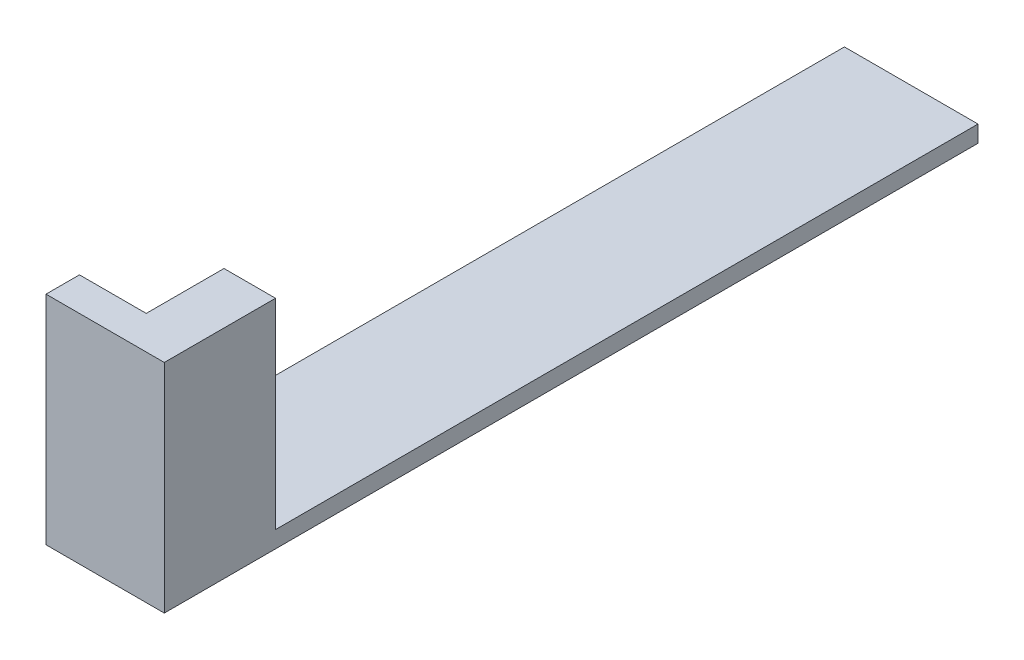
ISO-10303-21;
HEADER;
FILE_DESCRIPTION(('STEP AP214'),'2;1');
FILE_NAME('part.step','',(''),(''),'','','');
FILE_SCHEMA(('AUTOMOTIVE_DESIGN { 1 0 10303 214 1 1 1 1 }'));
ENDSEC;
DATA;
#1=APPLICATION_CONTEXT('core data for automotive mechanical design processes');
#2=APPLICATION_PROTOCOL_DEFINITION('international standard','automotive_design',2000,#1);
#3=PRODUCT_CONTEXT('',#1,'mechanical');
#4=PRODUCT('Part','Part','',(#3));
#5=PRODUCT_RELATED_PRODUCT_CATEGORY('part','',(#4));
#6=PRODUCT_DEFINITION_FORMATION('','',#4);
#7=PRODUCT_DEFINITION_CONTEXT('part definition',#1,'design');
#8=PRODUCT_DEFINITION('design','',#6,#7);
#9=PRODUCT_DEFINITION_SHAPE('','',#8);
#10=(LENGTH_UNIT() NAMED_UNIT(*) SI_UNIT(.MILLI.,.METRE.));
#11=(NAMED_UNIT(*) PLANE_ANGLE_UNIT() SI_UNIT($,.RADIAN.));
#12=(NAMED_UNIT(*) SI_UNIT($,.STERADIAN.) SOLID_ANGLE_UNIT());
#13=UNCERTAINTY_MEASURE_WITH_UNIT(LENGTH_MEASURE(1.E-05),#10,'distance_accuracy_value','');
#14=(GEOMETRIC_REPRESENTATION_CONTEXT(3) GLOBAL_UNCERTAINTY_ASSIGNED_CONTEXT((#13)) GLOBAL_UNIT_ASSIGNED_CONTEXT((#10,
#11,#12)) REPRESENTATION_CONTEXT('',''));
#15=CARTESIAN_POINT('',(0.,0.,0.));
#16=DIRECTION('',(0.,0.,1.));
#17=DIRECTION('',(1.,0.,0.));
#18=AXIS2_PLACEMENT_3D('',#15,#16,#17);
#19=CARTESIAN_POINT('',(0.,1.,0.));
#20=DIRECTION('',(0.,-1.,0.));
#21=DIRECTION('',(0.,0.,-1.));
#22=AXIS2_PLACEMENT_3D('',#19,#20,#21);
#23=PLANE('',#22);
#24=DIRECTION('',(-1.,0.,0.));
#25=VECTOR('',#24,1.);
#26=CARTESIAN_POINT('',(4.91519608556246,1.,0.));
#27=LINE('',#26,#25);
#28=CARTESIAN_POINT('',(8.,1.,0.));
#29=VERTEX_POINT('',#28);
#30=CARTESIAN_POINT('',(4.91519608556246,1.,0.));
#31=VERTEX_POINT('',#30);
#32=EDGE_CURVE('E158',#29,#31,#27,.T.);
#33=ORIENTED_EDGE('',*,*,#32,.F.);
#34=DIRECTION('',(0.,0.,-1.));
#35=VECTOR('',#34,1.);
#36=CARTESIAN_POINT('',(8.,1.,0.));
#37=LINE('',#36,#35);
#38=CARTESIAN_POINT('',(8.,1.,-42.07));
#39=VERTEX_POINT('',#38);
#40=EDGE_CURVE('E144',#29,#39,#37,.T.);
#41=ORIENTED_EDGE('',*,*,#40,.T.);
#42=DIRECTION('',(-1.,0.,0.));
#43=VECTOR('',#42,1.);
#44=CARTESIAN_POINT('',(0.,1.,-42.07));
#45=LINE('',#44,#43);
#46=CARTESIAN_POINT('',(0.,1.,-42.07));
#47=VERTEX_POINT('',#46);
#48=EDGE_CURVE('E64',#39,#47,#45,.T.);
#49=ORIENTED_EDGE('',*,*,#48,.T.);
#50=DIRECTION('',(0.,0.,1.));
#51=VECTOR('',#50,1.);
#52=CARTESIAN_POINT('',(0.,1.,0.));
#53=LINE('',#52,#51);
#54=CARTESIAN_POINT('',(0.,1.,0.));
#55=VERTEX_POINT('',#54);
#56=EDGE_CURVE('E201',#47,#55,#53,.T.);
#57=ORIENTED_EDGE('',*,*,#56,.T.);
#58=DIRECTION('',(1.,0.,0.));
#59=VECTOR('',#58,1.);
#60=CARTESIAN_POINT('',(0.,1.,0.));
#61=LINE('',#60,#59);
#62=EDGE_CURVE('E87',#55,#31,#61,.T.);
#63=ORIENTED_EDGE('',*,*,#62,.T.);
#64=EDGE_LOOP('',(#33,#41,#49,#57,#63));
#65=FACE_BOUND('',#64,.T.);
#66=ADVANCED_FACE('F39',(#65),#23,.F.);
#67=CARTESIAN_POINT('',(0.915196085562456,0.,4.65685647861847));
#68=DIRECTION('',(0.,0.,1.));
#69=DIRECTION('',(1.,0.,0.));
#70=AXIS2_PLACEMENT_3D('',#67,#68,#69);
#71=PLANE('',#70);
#72=DIRECTION('',(-1.,0.,0.));
#73=VECTOR('',#72,1.);
#74=CARTESIAN_POINT('',(8.,13.,4.65685647861847));
#75=LINE('',#74,#73);
#76=CARTESIAN_POINT('',(4.91519608556246,13.,4.65685647861847));
#77=VERTEX_POINT('',#76);
#78=CARTESIAN_POINT('',(0.915196085562456,13.,4.65685647861847));
#79=VERTEX_POINT('',#78);
#80=EDGE_CURVE('E138',#77,#79,#75,.T.);
#81=ORIENTED_EDGE('',*,*,#80,.F.);
#82=DIRECTION('',(0.,-1.,0.));
#83=VECTOR('',#82,1.);
#84=CARTESIAN_POINT('',(4.91519608556246,0.,4.65685647861847));
#85=LINE('',#84,#83);
#86=CARTESIAN_POINT('',(4.91519608556246,0.,4.65685647861847));
#87=VERTEX_POINT('',#86);
#88=EDGE_CURVE('E55',#77,#87,#85,.T.);
#89=ORIENTED_EDGE('',*,*,#88,.T.);
#90=DIRECTION('',(1.,0.,0.));
#91=VECTOR('',#90,1.);
#92=CARTESIAN_POINT('',(0.915196085562456,0.,4.65685647861847));
#93=LINE('',#92,#91);
#94=CARTESIAN_POINT('',(0.915196085562456,0.,4.65685647861847));
#95=VERTEX_POINT('',#94);
#96=EDGE_CURVE('E181',#95,#87,#93,.T.);
#97=ORIENTED_EDGE('',*,*,#96,.F.);
#98=DIRECTION('',(0.,-1.,0.));
#99=VECTOR('',#98,1.);
#100=CARTESIAN_POINT('',(0.915196085562456,0.,4.65685647861847));
#101=LINE('',#100,#99);
#102=EDGE_CURVE('E170',#79,#95,#101,.T.);
#103=ORIENTED_EDGE('',*,*,#102,.F.);
#104=EDGE_LOOP('',(#81,#89,#97,#103));
#105=FACE_BOUND('',#104,.T.);
#106=ADVANCED_FACE('F239',(#105),#71,.F.);
#107=CARTESIAN_POINT('',(4.91519608556246,0.,4.66));
#108=DIRECTION('',(1.,0.,0.));
#109=DIRECTION('',(0.,0.,-1.));
#110=AXIS2_PLACEMENT_3D('',#107,#108,#109);
#111=PLANE('',#110);
#112=ORIENTED_EDGE('',*,*,#88,.F.);
#113=DIRECTION('',(0.,0.,1.));
#114=VECTOR('',#113,1.);
#115=CARTESIAN_POINT('',(4.91519608556246,13.,0.));
#116=LINE('',#115,#114);
#117=CARTESIAN_POINT('',(4.91519608556246,13.,0.));
#118=VERTEX_POINT('',#117);
#119=EDGE_CURVE('E153',#118,#77,#116,.T.);
#120=ORIENTED_EDGE('',*,*,#119,.F.);
#121=DIRECTION('',(0.,-1.,0.));
#122=VECTOR('',#121,1.);
#123=CARTESIAN_POINT('',(4.91519608556246,13.,0.));
#124=LINE('',#123,#122);
#125=EDGE_CURVE('E148',#118,#31,#124,.T.);
#126=ORIENTED_EDGE('',*,*,#125,.T.);
#127=DIRECTION('',(0.,-1.,0.));
#128=VECTOR('',#127,1.);
#129=CARTESIAN_POINT('',(4.91519608556246,0.,0.));
#130=LINE('',#129,#128);
#131=CARTESIAN_POINT('',(4.91519608556246,0.,0.));
#132=VERTEX_POINT('',#131);
#133=EDGE_CURVE('E193',#31,#132,#130,.T.);
#134=ORIENTED_EDGE('',*,*,#133,.T.);
#135=DIRECTION('',(0.,0.,-1.));
#136=VECTOR('',#135,1.);
#137=CARTESIAN_POINT('',(4.91519608556246,0.,4.66));
#138=LINE('',#137,#136);
#139=EDGE_CURVE('E197',#87,#132,#138,.T.);
#140=ORIENTED_EDGE('',*,*,#139,.F.);
#141=EDGE_LOOP('',(#112,#120,#126,#134,#140));
#142=FACE_BOUND('',#141,.T.);
#143=ADVANCED_FACE('F232',(#142),#111,.F.);
#144=CARTESIAN_POINT('',(0.,1.,0.));
#145=DIRECTION('',(0.,0.,-1.));
#146=DIRECTION('',(-1.,0.,0.));
#147=AXIS2_PLACEMENT_3D('',#144,#145,#146);
#148=PLANE('',#147);
#149=ORIENTED_EDGE('',*,*,#133,.F.);
#150=ORIENTED_EDGE('',*,*,#62,.F.);
#151=DIRECTION('',(0.,-1.,0.));
#152=VECTOR('',#151,1.);
#153=CARTESIAN_POINT('',(0.,1.,0.));
#154=LINE('',#153,#152);
#155=CARTESIAN_POINT('',(0.,0.,0.));
#156=VERTEX_POINT('',#155);
#157=EDGE_CURVE('E11',#55,#156,#154,.T.);
#158=ORIENTED_EDGE('',*,*,#157,.T.);
#159=DIRECTION('',(1.,0.,0.));
#160=VECTOR('',#159,1.);
#161=CARTESIAN_POINT('',(0.,0.,0.));
#162=LINE('',#161,#160);
#163=EDGE_CURVE('E214',#156,#132,#162,.T.);
#164=ORIENTED_EDGE('',*,*,#163,.T.);
#165=EDGE_LOOP('',(#149,#150,#158,#164));
#166=FACE_BOUND('',#165,.T.);
#167=ADVANCED_FACE('F233',(#166),#148,.F.);
#168=CARTESIAN_POINT('',(0.,1.,0.));
#169=DIRECTION('',(1.,0.,0.));
#170=DIRECTION('',(0.,0.,-1.));
#171=AXIS2_PLACEMENT_3D('',#168,#169,#170);
#172=PLANE('',#171);
#173=DIRECTION('',(0.,0.,1.));
#174=VECTOR('',#173,1.);
#175=CARTESIAN_POINT('',(0.,0.,0.));
#176=LINE('',#175,#174);
#177=CARTESIAN_POINT('',(0.,0.,-42.07));
#178=VERTEX_POINT('',#177);
#179=EDGE_CURVE('E200',#178,#156,#176,.T.);
#180=ORIENTED_EDGE('',*,*,#179,.T.);
#181=ORIENTED_EDGE('',*,*,#157,.F.);
#182=ORIENTED_EDGE('',*,*,#56,.F.);
#183=DIRECTION('',(0.,-1.,0.));
#184=VECTOR('',#183,1.);
#185=CARTESIAN_POINT('',(0.,1.,-42.07));
#186=LINE('',#185,#184);
#187=EDGE_CURVE('E210',#47,#178,#186,.T.);
#188=ORIENTED_EDGE('',*,*,#187,.T.);
#189=EDGE_LOOP('',(#180,#181,#182,#188));
#190=FACE_BOUND('',#189,.T.);
#191=ADVANCED_FACE('F41',(#190),#172,.F.);
#192=CARTESIAN_POINT('',(8.,1.,0.));
#193=DIRECTION('',(-1.,0.,0.));
#194=DIRECTION('',(0.,0.,1.));
#195=AXIS2_PLACEMENT_3D('',#192,#193,#194);
#196=PLANE('',#195);
#197=ORIENTED_EDGE('',*,*,#40,.F.);
#198=DIRECTION('',(0.,-1.,0.));
#199=VECTOR('',#198,1.);
#200=CARTESIAN_POINT('',(8.,13.,0.));
#201=LINE('',#200,#199);
#202=CARTESIAN_POINT('',(8.,13.,0.));
#203=VERTEX_POINT('',#202);
#204=EDGE_CURVE('E139',#203,#29,#201,.T.);
#205=ORIENTED_EDGE('',*,*,#204,.F.);
#206=DIRECTION('',(0.,0.,-1.));
#207=VECTOR('',#206,1.);
#208=CARTESIAN_POINT('',(8.,13.,6.66));
#209=LINE('',#208,#207);
#210=CARTESIAN_POINT('',(8.,13.,6.66));
#211=VERTEX_POINT('',#210);
#212=EDGE_CURVE('E126',#211,#203,#209,.T.);
#213=ORIENTED_EDGE('',*,*,#212,.F.);
#214=DIRECTION('',(0.,1.,0.));
#215=VECTOR('',#214,1.);
#216=CARTESIAN_POINT('',(8.,1.,6.66));
#217=LINE('',#216,#215);
#218=CARTESIAN_POINT('',(8.,0.,6.66));
#219=VERTEX_POINT('',#218);
#220=EDGE_CURVE('E190',#219,#211,#217,.T.);
#221=ORIENTED_EDGE('',*,*,#220,.F.);
#222=DIRECTION('',(0.,0.,-1.));
#223=VECTOR('',#222,1.);
#224=CARTESIAN_POINT('',(8.,0.,0.));
#225=LINE('',#224,#223);
#226=CARTESIAN_POINT('',(8.,0.,-42.07));
#227=VERTEX_POINT('',#226);
#228=EDGE_CURVE('E218',#219,#227,#225,.T.);
#229=ORIENTED_EDGE('',*,*,#228,.T.);
#230=DIRECTION('',(0.,-1.,0.));
#231=VECTOR('',#230,1.);
#232=CARTESIAN_POINT('',(8.,1.,-42.07));
#233=LINE('',#232,#231);
#234=EDGE_CURVE('E48',#39,#227,#233,.T.);
#235=ORIENTED_EDGE('',*,*,#234,.F.);
#236=EDGE_LOOP('',(#197,#205,#213,#221,#229,#235));
#237=FACE_BOUND('',#236,.T.);
#238=ADVANCED_FACE('F142',(#237),#196,.F.);
#239=CARTESIAN_POINT('',(0.,1.,-42.07));
#240=DIRECTION('',(0.,0.,1.));
#241=DIRECTION('',(1.,0.,0.));
#242=AXIS2_PLACEMENT_3D('',#239,#240,#241);
#243=PLANE('',#242);
#244=DIRECTION('',(-1.,0.,0.));
#245=VECTOR('',#244,1.);
#246=CARTESIAN_POINT('',(0.,0.,-42.07));
#247=LINE('',#246,#245);
#248=EDGE_CURVE('E81',#227,#178,#247,.T.);
#249=ORIENTED_EDGE('',*,*,#248,.T.);
#250=ORIENTED_EDGE('',*,*,#187,.F.);
#251=ORIENTED_EDGE('',*,*,#48,.F.);
#252=ORIENTED_EDGE('',*,*,#234,.T.);
#253=EDGE_LOOP('',(#249,#250,#251,#252));
#254=FACE_BOUND('',#253,.T.);
#255=ADVANCED_FACE('F225',(#254),#243,.F.);
#256=CARTESIAN_POINT('',(0.,0.,0.));
#257=DIRECTION('',(0.,-1.,0.));
#258=DIRECTION('',(0.,0.,-1.));
#259=AXIS2_PLACEMENT_3D('',#256,#257,#258);
#260=PLANE('',#259);
#261=ORIENTED_EDGE('',*,*,#179,.F.);
#262=ORIENTED_EDGE('',*,*,#248,.F.);
#263=ORIENTED_EDGE('',*,*,#228,.F.);
#264=DIRECTION('',(1.,0.,0.));
#265=VECTOR('',#264,1.);
#266=CARTESIAN_POINT('',(4.91519608556246,0.,6.66));
#267=LINE('',#266,#265);
#268=CARTESIAN_POINT('',(0.915196085562456,0.,6.66));
#269=VERTEX_POINT('',#268);
#270=EDGE_CURVE('E186',#269,#219,#267,.T.);
#271=ORIENTED_EDGE('',*,*,#270,.F.);
#272=DIRECTION('',(0.,0.,1.));
#273=VECTOR('',#272,1.);
#274=CARTESIAN_POINT('',(0.915196085562456,0.,4.65685647861847));
#275=LINE('',#274,#273);
#276=EDGE_CURVE('E174',#95,#269,#275,.T.);
#277=ORIENTED_EDGE('',*,*,#276,.F.);
#278=ORIENTED_EDGE('',*,*,#96,.T.);
#279=ORIENTED_EDGE('',*,*,#139,.T.);
#280=ORIENTED_EDGE('',*,*,#163,.F.);
#281=EDGE_LOOP('',(#261,#262,#263,#271,#277,#278,#279,#280));
#282=FACE_BOUND('',#281,.T.);
#283=ADVANCED_FACE('F228',(#282),#260,.T.);
#284=CARTESIAN_POINT('',(0.,0.,6.66));
#285=DIRECTION('',(0.,0.,1.));
#286=DIRECTION('',(1.,0.,0.));
#287=AXIS2_PLACEMENT_3D('',#284,#285,#286);
#288=PLANE('',#287);
#289=ORIENTED_EDGE('',*,*,#220,.T.);
#290=DIRECTION('',(1.,0.,0.));
#291=VECTOR('',#290,1.);
#292=CARTESIAN_POINT('',(8.,13.,6.66));
#293=LINE('',#292,#291);
#294=CARTESIAN_POINT('',(0.915196085562456,13.,6.66));
#295=VERTEX_POINT('',#294);
#296=EDGE_CURVE('E134',#295,#211,#293,.T.);
#297=ORIENTED_EDGE('',*,*,#296,.F.);
#298=DIRECTION('',(0.,1.,0.));
#299=VECTOR('',#298,1.);
#300=CARTESIAN_POINT('',(0.915196085562456,0.,6.66));
#301=LINE('',#300,#299);
#302=EDGE_CURVE('E178',#269,#295,#301,.T.);
#303=ORIENTED_EDGE('',*,*,#302,.F.);
#304=ORIENTED_EDGE('',*,*,#270,.T.);
#305=EDGE_LOOP('',(#289,#297,#303,#304));
#306=FACE_BOUND('',#305,.T.);
#307=ADVANCED_FACE('F253',(#306),#288,.T.);
#308=CARTESIAN_POINT('',(0.915196085562456,0.,0.));
#309=DIRECTION('',(1.,0.,0.));
#310=DIRECTION('',(0.,0.,-1.));
#311=AXIS2_PLACEMENT_3D('',#308,#309,#310);
#312=PLANE('',#311);
#313=ORIENTED_EDGE('',*,*,#102,.T.);
#314=ORIENTED_EDGE('',*,*,#276,.T.);
#315=ORIENTED_EDGE('',*,*,#302,.T.);
#316=DIRECTION('',(0.,0.,1.));
#317=VECTOR('',#316,1.);
#318=CARTESIAN_POINT('',(0.915196085562456,13.,6.66));
#319=LINE('',#318,#317);
#320=EDGE_CURVE('E165',#79,#295,#319,.T.);
#321=ORIENTED_EDGE('',*,*,#320,.F.);
#322=EDGE_LOOP('',(#313,#314,#315,#321));
#323=FACE_BOUND('',#322,.T.);
#324=ADVANCED_FACE('F275',(#323),#312,.F.);
#325=CARTESIAN_POINT('',(0.,13.,0.));
#326=DIRECTION('',(0.,1.,0.));
#327=DIRECTION('',(0.,0.,1.));
#328=AXIS2_PLACEMENT_3D('',#325,#326,#327);
#329=PLANE('',#328);
#330=ORIENTED_EDGE('',*,*,#212,.T.);
#331=DIRECTION('',(-1.,0.,0.));
#332=VECTOR('',#331,1.);
#333=CARTESIAN_POINT('',(4.91519608556246,13.,0.));
#334=LINE('',#333,#332);
#335=EDGE_CURVE('E130',#203,#118,#334,.T.);
#336=ORIENTED_EDGE('',*,*,#335,.T.);
#337=ORIENTED_EDGE('',*,*,#119,.T.);
#338=ORIENTED_EDGE('',*,*,#80,.T.);
#339=ORIENTED_EDGE('',*,*,#320,.T.);
#340=ORIENTED_EDGE('',*,*,#296,.T.);
#341=EDGE_LOOP('',(#330,#336,#337,#338,#339,#340));
#342=FACE_BOUND('',#341,.T.);
#343=ADVANCED_FACE('F128',(#342),#329,.T.);
#344=CARTESIAN_POINT('',(4.91519608556246,13.,0.));
#345=DIRECTION('',(0.,0.,1.));
#346=DIRECTION('',(1.,0.,0.));
#347=AXIS2_PLACEMENT_3D('',#344,#345,#346);
#348=PLANE('',#347);
#349=ORIENTED_EDGE('',*,*,#32,.T.);
#350=ORIENTED_EDGE('',*,*,#125,.F.);
#351=ORIENTED_EDGE('',*,*,#335,.F.);
#352=ORIENTED_EDGE('',*,*,#204,.T.);
#353=EDGE_LOOP('',(#349,#350,#351,#352));
#354=FACE_BOUND('',#353,.T.);
#355=ADVANCED_FACE('F150',(#354),#348,.F.);
#356=CLOSED_SHELL('',(#66,#106,#143,#167,#191,#238,#255,#283,#307,#324,#343,#355));
#357=MANIFOLD_SOLID_BREP('B2',#356);
#358=ADVANCED_BREP_SHAPE_REPRESENTATION('',(#18,#357),#14);
#359=SHAPE_DEFINITION_REPRESENTATION(#9,#358);
ENDSEC;
END-ISO-10303-21;
